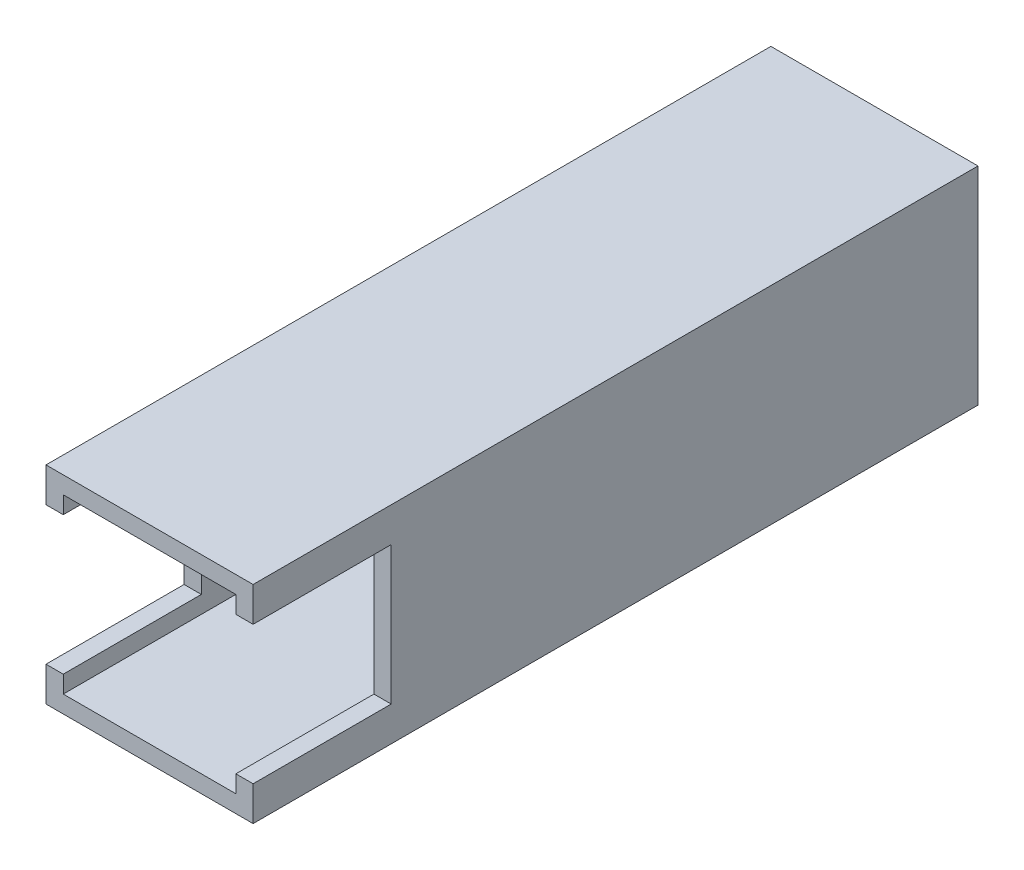
ISO-10303-21;
HEADER;
FILE_DESCRIPTION(('STEP AP214'),'2;1');
FILE_NAME('part.step','',(''),(''),'','','');
FILE_SCHEMA(('AUTOMOTIVE_DESIGN { 1 0 10303 214 1 1 1 1 }'));
ENDSEC;
DATA;
#1=APPLICATION_CONTEXT('core data for automotive mechanical design processes');
#2=APPLICATION_PROTOCOL_DEFINITION('international standard','automotive_design',2000,#1);
#3=PRODUCT_CONTEXT('',#1,'mechanical');
#4=PRODUCT('Part','Part','',(#3));
#5=PRODUCT_RELATED_PRODUCT_CATEGORY('part','',(#4));
#6=PRODUCT_DEFINITION_FORMATION('','',#4);
#7=PRODUCT_DEFINITION_CONTEXT('part definition',#1,'design');
#8=PRODUCT_DEFINITION('design','',#6,#7);
#9=PRODUCT_DEFINITION_SHAPE('','',#8);
#10=(LENGTH_UNIT() NAMED_UNIT(*) SI_UNIT(.MILLI.,.METRE.));
#11=(NAMED_UNIT(*) PLANE_ANGLE_UNIT() SI_UNIT($,.RADIAN.));
#12=(NAMED_UNIT(*) SI_UNIT($,.STERADIAN.) SOLID_ANGLE_UNIT());
#13=UNCERTAINTY_MEASURE_WITH_UNIT(LENGTH_MEASURE(1.E-05),#10,'distance_accuracy_value','');
#14=(GEOMETRIC_REPRESENTATION_CONTEXT(3) GLOBAL_UNCERTAINTY_ASSIGNED_CONTEXT((#13)) GLOBAL_UNIT_ASSIGNED_CONTEXT((#10,
#11,#12)) REPRESENTATION_CONTEXT('',''));
#15=CARTESIAN_POINT('',(0.,0.,0.));
#16=DIRECTION('',(0.,0.,1.));
#17=DIRECTION('',(1.,0.,0.));
#18=AXIS2_PLACEMENT_3D('',#15,#16,#17);
#19=CARTESIAN_POINT('',(-19.05,19.05,66.675));
#20=DIRECTION('',(0.,0.,-1.));
#21=DIRECTION('',(-1.,0.,0.));
#22=AXIS2_PLACEMENT_3D('',#19,#20,#21);
#23=PLANE('',#22);
#24=DIRECTION('',(0.,-1.,0.));
#25=VECTOR('',#24,1.);
#26=CARTESIAN_POINT('',(-19.05,19.05,66.675));
#27=LINE('',#26,#25);
#28=CARTESIAN_POINT('',(-19.05,19.05,66.675));
#29=VERTEX_POINT('',#28);
#30=CARTESIAN_POINT('',(-19.05,12.7,66.675));
#31=VERTEX_POINT('',#30);
#32=EDGE_CURVE('E170',#29,#31,#27,.T.);
#33=ORIENTED_EDGE('',*,*,#32,.T.);
#34=DIRECTION('',(1.,0.,0.));
#35=VECTOR('',#34,1.);
#36=CARTESIAN_POINT('',(-19.05,12.7,66.675));
#37=LINE('',#36,#35);
#38=CARTESIAN_POINT('',(-15.875,12.7,66.675));
#39=VERTEX_POINT('',#38);
#40=EDGE_CURVE('E201',#31,#39,#37,.T.);
#41=ORIENTED_EDGE('',*,*,#40,.T.);
#42=DIRECTION('',(0.,-1.,0.));
#43=VECTOR('',#42,1.);
#44=CARTESIAN_POINT('',(-15.875,15.875,66.675));
#45=LINE('',#44,#43);
#46=CARTESIAN_POINT('',(-15.875,15.875,66.675));
#47=VERTEX_POINT('',#46);
#48=EDGE_CURVE('E226',#47,#39,#45,.T.);
#49=ORIENTED_EDGE('',*,*,#48,.F.);
#50=DIRECTION('',(-1.,0.,0.));
#51=VECTOR('',#50,1.);
#52=CARTESIAN_POINT('',(-15.875,15.875,66.675));
#53=LINE('',#52,#51);
#54=CARTESIAN_POINT('',(15.875,15.875,66.675));
#55=VERTEX_POINT('',#54);
#56=EDGE_CURVE('E216',#55,#47,#53,.T.);
#57=ORIENTED_EDGE('',*,*,#56,.F.);
#58=DIRECTION('',(0.,1.,0.));
#59=VECTOR('',#58,1.);
#60=CARTESIAN_POINT('',(15.875,15.875,66.675));
#61=LINE('',#60,#59);
#62=CARTESIAN_POINT('',(15.875,12.7,66.675));
#63=VERTEX_POINT('',#62);
#64=EDGE_CURVE('E232',#63,#55,#61,.T.);
#65=ORIENTED_EDGE('',*,*,#64,.F.);
#66=CARTESIAN_POINT('',(19.05,12.7,66.675));
#67=VERTEX_POINT('',#66);
#68=EDGE_CURVE('E198',#63,#67,#37,.T.);
#69=ORIENTED_EDGE('',*,*,#68,.T.);
#70=DIRECTION('',(0.,-1.,0.));
#71=VECTOR('',#70,1.);
#72=CARTESIAN_POINT('',(19.05,19.05,66.675));
#73=LINE('',#72,#71);
#74=CARTESIAN_POINT('',(19.05,19.05,66.675));
#75=VERTEX_POINT('',#74);
#76=EDGE_CURVE('E171',#75,#67,#73,.T.);
#77=ORIENTED_EDGE('',*,*,#76,.F.);
#78=DIRECTION('',(1.,0.,0.));
#79=VECTOR('',#78,1.);
#80=CARTESIAN_POINT('',(-19.05,19.05,66.675));
#81=LINE('',#80,#79);
#82=EDGE_CURVE('E249',#29,#75,#81,.T.);
#83=ORIENTED_EDGE('',*,*,#82,.F.);
#84=EDGE_LOOP('',(#33,#41,#49,#57,#65,#69,#77,#83));
#85=FACE_BOUND('',#84,.T.);
#86=ADVANCED_FACE('F33',(#85),#23,.F.);
#87=CARTESIAN_POINT('',(-19.05,19.05,-66.675));
#88=DIRECTION('',(1.,0.,0.));
#89=DIRECTION('',(0.,0.,-1.));
#90=AXIS2_PLACEMENT_3D('',#87,#88,#89);
#91=PLANE('',#90);
#92=DIRECTION('',(0.,1.,0.));
#93=VECTOR('',#92,1.);
#94=CARTESIAN_POINT('',(-19.05,12.7,41.275));
#95=LINE('',#94,#93);
#96=CARTESIAN_POINT('',(-19.05,-12.7,41.275));
#97=VERTEX_POINT('',#96);
#98=CARTESIAN_POINT('',(-19.05,12.7,41.275));
#99=VERTEX_POINT('',#98);
#100=EDGE_CURVE('E152',#97,#99,#95,.T.);
#101=ORIENTED_EDGE('',*,*,#100,.T.);
#102=DIRECTION('',(0.,0.,1.));
#103=VECTOR('',#102,1.);
#104=CARTESIAN_POINT('',(-19.05,12.7,66.675));
#105=LINE('',#104,#103);
#106=EDGE_CURVE('E440',#99,#31,#105,.T.);
#107=ORIENTED_EDGE('',*,*,#106,.T.);
#108=ORIENTED_EDGE('',*,*,#32,.F.);
#109=DIRECTION('',(0.,0.,1.));
#110=VECTOR('',#109,1.);
#111=CARTESIAN_POINT('',(-19.05,19.05,-66.675));
#112=LINE('',#111,#110);
#113=CARTESIAN_POINT('',(-19.05,19.05,-66.675));
#114=VERTEX_POINT('',#113);
#115=EDGE_CURVE('E246',#114,#29,#112,.T.);
#116=ORIENTED_EDGE('',*,*,#115,.F.);
#117=DIRECTION('',(0.,-1.,0.));
#118=VECTOR('',#117,1.);
#119=CARTESIAN_POINT('',(-19.05,19.05,-66.675));
#120=LINE('',#119,#118);
#121=CARTESIAN_POINT('',(-19.05,-19.05,-66.675));
#122=VERTEX_POINT('',#121);
#123=EDGE_CURVE('E256',#114,#122,#120,.T.);
#124=ORIENTED_EDGE('',*,*,#123,.T.);
#125=DIRECTION('',(0.,0.,1.));
#126=VECTOR('',#125,1.);
#127=CARTESIAN_POINT('',(-19.05,-19.05,-66.675));
#128=LINE('',#127,#126);
#129=CARTESIAN_POINT('',(-19.05,-19.05,66.675));
#130=VERTEX_POINT('',#129);
#131=EDGE_CURVE('E169',#122,#130,#128,.T.);
#132=ORIENTED_EDGE('',*,*,#131,.T.);
#133=CARTESIAN_POINT('',(-19.05,-12.7,66.675));
#134=VERTEX_POINT('',#133);
#135=EDGE_CURVE('E160',#134,#130,#27,.T.);
#136=ORIENTED_EDGE('',*,*,#135,.F.);
#137=DIRECTION('',(0.,0.,-1.));
#138=VECTOR('',#137,1.);
#139=CARTESIAN_POINT('',(-19.05,-12.7,66.675));
#140=LINE('',#139,#138);
#141=EDGE_CURVE('E144',#134,#97,#140,.T.);
#142=ORIENTED_EDGE('',*,*,#141,.T.);
#143=EDGE_LOOP('',(#101,#107,#108,#116,#124,#132,#136,#142));
#144=FACE_BOUND('',#143,.T.);
#145=ADVANCED_FACE('F35',(#144),#91,.F.);
#146=CARTESIAN_POINT('',(19.05,-12.7,66.675));
#147=VERTEX_POINT('',#146);
#148=CARTESIAN_POINT('',(19.05,-19.05,66.675));
#149=VERTEX_POINT('',#148);
#150=EDGE_CURVE('E176',#147,#149,#73,.T.);
#151=ORIENTED_EDGE('',*,*,#150,.F.);
#152=DIRECTION('',(1.,0.,0.));
#153=VECTOR('',#152,1.);
#154=CARTESIAN_POINT('',(-19.05,-12.7,66.675));
#155=LINE('',#154,#153);
#156=CARTESIAN_POINT('',(15.875,-12.7,66.675));
#157=VERTEX_POINT('',#156);
#158=EDGE_CURVE('E164',#157,#147,#155,.T.);
#159=ORIENTED_EDGE('',*,*,#158,.F.);
#160=CARTESIAN_POINT('',(15.875,-15.875,66.675));
#161=VERTEX_POINT('',#160);
#162=EDGE_CURVE('E233',#161,#157,#61,.T.);
#163=ORIENTED_EDGE('',*,*,#162,.F.);
#164=DIRECTION('',(1.,0.,0.));
#165=VECTOR('',#164,1.);
#166=CARTESIAN_POINT('',(-15.875,-15.875,66.675));
#167=LINE('',#166,#165);
#168=CARTESIAN_POINT('',(-15.875,-15.875,66.675));
#169=VERTEX_POINT('',#168);
#170=EDGE_CURVE('E229',#169,#161,#167,.T.);
#171=ORIENTED_EDGE('',*,*,#170,.F.);
#172=CARTESIAN_POINT('',(-15.875,-12.7,66.675));
#173=VERTEX_POINT('',#172);
#174=EDGE_CURVE('E163',#173,#169,#45,.T.);
#175=ORIENTED_EDGE('',*,*,#174,.F.);
#176=EDGE_CURVE('E48',#134,#173,#155,.T.);
#177=ORIENTED_EDGE('',*,*,#176,.F.);
#178=ORIENTED_EDGE('',*,*,#135,.T.);
#179=DIRECTION('',(1.,0.,0.));
#180=VECTOR('',#179,1.);
#181=CARTESIAN_POINT('',(-19.05,-19.05,66.675));
#182=LINE('',#181,#180);
#183=EDGE_CURVE('E258',#130,#149,#182,.T.);
#184=ORIENTED_EDGE('',*,*,#183,.T.);
#185=EDGE_LOOP('',(#151,#159,#163,#171,#175,#177,#178,#184));
#186=FACE_BOUND('',#185,.T.);
#187=ADVANCED_FACE('F158',(#186),#23,.F.);
#188=CARTESIAN_POINT('',(19.05,19.05,-66.675));
#189=DIRECTION('',(-1.,0.,0.));
#190=DIRECTION('',(0.,0.,1.));
#191=AXIS2_PLACEMENT_3D('',#188,#189,#190);
#192=PLANE('',#191);
#193=ORIENTED_EDGE('',*,*,#76,.T.);
#194=DIRECTION('',(0.,0.,1.));
#195=VECTOR('',#194,1.);
#196=CARTESIAN_POINT('',(19.05,12.7,66.675));
#197=LINE('',#196,#195);
#198=CARTESIAN_POINT('',(19.05,12.7,41.275));
#199=VERTEX_POINT('',#198);
#200=EDGE_CURVE('E153',#199,#67,#197,.T.);
#201=ORIENTED_EDGE('',*,*,#200,.F.);
#202=DIRECTION('',(0.,1.,0.));
#203=VECTOR('',#202,1.);
#204=CARTESIAN_POINT('',(19.05,12.7,41.275));
#205=LINE('',#204,#203);
#206=CARTESIAN_POINT('',(19.05,-12.7,41.275));
#207=VERTEX_POINT('',#206);
#208=EDGE_CURVE('E192',#207,#199,#205,.T.);
#209=ORIENTED_EDGE('',*,*,#208,.F.);
#210=DIRECTION('',(0.,0.,-1.));
#211=VECTOR('',#210,1.);
#212=CARTESIAN_POINT('',(19.05,-12.7,66.675));
#213=LINE('',#212,#211);
#214=EDGE_CURVE('E273',#147,#207,#213,.T.);
#215=ORIENTED_EDGE('',*,*,#214,.F.);
#216=ORIENTED_EDGE('',*,*,#150,.T.);
#217=DIRECTION('',(0.,0.,-1.));
#218=VECTOR('',#217,1.);
#219=CARTESIAN_POINT('',(19.05,-19.05,-66.675));
#220=LINE('',#219,#218);
#221=CARTESIAN_POINT('',(19.05,-19.05,-66.675));
#222=VERTEX_POINT('',#221);
#223=EDGE_CURVE('E260',#149,#222,#220,.T.);
#224=ORIENTED_EDGE('',*,*,#223,.T.);
#225=DIRECTION('',(0.,-1.,0.));
#226=VECTOR('',#225,1.);
#227=CARTESIAN_POINT('',(19.05,19.05,-66.675));
#228=LINE('',#227,#226);
#229=CARTESIAN_POINT('',(19.05,19.05,-66.675));
#230=VERTEX_POINT('',#229);
#231=EDGE_CURVE('E263',#230,#222,#228,.T.);
#232=ORIENTED_EDGE('',*,*,#231,.F.);
#233=DIRECTION('',(0.,0.,-1.));
#234=VECTOR('',#233,1.);
#235=CARTESIAN_POINT('',(19.05,19.05,-66.675));
#236=LINE('',#235,#234);
#237=EDGE_CURVE('E252',#75,#230,#236,.T.);
#238=ORIENTED_EDGE('',*,*,#237,.F.);
#239=EDGE_LOOP('',(#193,#201,#209,#215,#216,#224,#232,#238));
#240=FACE_BOUND('',#239,.T.);
#241=ADVANCED_FACE('F271',(#240),#192,.F.);
#242=CARTESIAN_POINT('',(-19.05,19.05,-66.675));
#243=DIRECTION('',(0.,0.,1.));
#244=DIRECTION('',(1.,0.,0.));
#245=AXIS2_PLACEMENT_3D('',#242,#243,#244);
#246=PLANE('',#245);
#247=DIRECTION('',(-1.,0.,0.));
#248=VECTOR('',#247,1.);
#249=CARTESIAN_POINT('',(-15.875,15.875,-66.675));
#250=LINE('',#249,#248);
#251=CARTESIAN_POINT('',(15.875,15.875,-66.675));
#252=VERTEX_POINT('',#251);
#253=CARTESIAN_POINT('',(-15.875,15.875,-66.675));
#254=VERTEX_POINT('',#253);
#255=EDGE_CURVE('E222',#252,#254,#250,.T.);
#256=ORIENTED_EDGE('',*,*,#255,.T.);
#257=DIRECTION('',(0.,-1.,0.));
#258=VECTOR('',#257,1.);
#259=CARTESIAN_POINT('',(-15.875,15.875,-66.675));
#260=LINE('',#259,#258);
#261=CARTESIAN_POINT('',(-15.875,-15.875,-66.675));
#262=VERTEX_POINT('',#261);
#263=EDGE_CURVE('E212',#254,#262,#260,.T.);
#264=ORIENTED_EDGE('',*,*,#263,.T.);
#265=DIRECTION('',(1.,0.,0.));
#266=VECTOR('',#265,1.);
#267=CARTESIAN_POINT('',(-15.875,-15.875,-66.675));
#268=LINE('',#267,#266);
#269=CARTESIAN_POINT('',(15.875,-15.875,-66.675));
#270=VERTEX_POINT('',#269);
#271=EDGE_CURVE('E215',#262,#270,#268,.T.);
#272=ORIENTED_EDGE('',*,*,#271,.T.);
#273=DIRECTION('',(0.,1.,0.));
#274=VECTOR('',#273,1.);
#275=CARTESIAN_POINT('',(15.875,15.875,-66.675));
#276=LINE('',#275,#274);
#277=EDGE_CURVE('E219',#270,#252,#276,.T.);
#278=ORIENTED_EDGE('',*,*,#277,.T.);
#279=EDGE_LOOP('',(#256,#264,#272,#278));
#280=FACE_BOUND('',#279,.T.);
#281=DIRECTION('',(-1.,0.,0.));
#282=VECTOR('',#281,1.);
#283=CARTESIAN_POINT('',(-19.05,-19.05,-66.675));
#284=LINE('',#283,#282);
#285=EDGE_CURVE('E250',#222,#122,#284,.T.);
#286=ORIENTED_EDGE('',*,*,#285,.T.);
#287=ORIENTED_EDGE('',*,*,#123,.F.);
#288=DIRECTION('',(-1.,0.,0.));
#289=VECTOR('',#288,1.);
#290=CARTESIAN_POINT('',(-19.05,19.05,-66.675));
#291=LINE('',#290,#289);
#292=EDGE_CURVE('E254',#230,#114,#291,.T.);
#293=ORIENTED_EDGE('',*,*,#292,.F.);
#294=ORIENTED_EDGE('',*,*,#231,.T.);
#295=EDGE_LOOP('',(#286,#287,#293,#294));
#296=FACE_BOUND('',#295,.T.);
#297=ADVANCED_FACE('F278',(#280,#296),#246,.F.);
#298=CARTESIAN_POINT('',(0.,19.05,0.));
#299=DIRECTION('',(0.,1.,0.));
#300=DIRECTION('',(0.,0.,1.));
#301=AXIS2_PLACEMENT_3D('',#298,#299,#300);
#302=PLANE('',#301);
#303=ORIENTED_EDGE('',*,*,#115,.T.);
#304=ORIENTED_EDGE('',*,*,#82,.T.);
#305=ORIENTED_EDGE('',*,*,#237,.T.);
#306=ORIENTED_EDGE('',*,*,#292,.T.);
#307=EDGE_LOOP('',(#303,#304,#305,#306));
#308=FACE_BOUND('',#307,.T.);
#309=ADVANCED_FACE('F283',(#308),#302,.T.);
#310=CARTESIAN_POINT('',(0.,-19.05,0.));
#311=DIRECTION('',(0.,1.,0.));
#312=DIRECTION('',(0.,0.,1.));
#313=AXIS2_PLACEMENT_3D('',#310,#311,#312);
#314=PLANE('',#313);
#315=ORIENTED_EDGE('',*,*,#131,.F.);
#316=ORIENTED_EDGE('',*,*,#285,.F.);
#317=ORIENTED_EDGE('',*,*,#223,.F.);
#318=ORIENTED_EDGE('',*,*,#183,.F.);
#319=EDGE_LOOP('',(#315,#316,#317,#318));
#320=FACE_BOUND('',#319,.T.);
#321=ADVANCED_FACE('F276',(#320),#314,.F.);
#322=CARTESIAN_POINT('',(-15.875,15.875,-66.675));
#323=DIRECTION('',(-1.,0.,0.));
#324=DIRECTION('',(0.,-1.,0.));
#325=AXIS2_PLACEMENT_3D('',#322,#323,#324);
#326=PLANE('',#325);
#327=ORIENTED_EDGE('',*,*,#48,.T.);
#328=DIRECTION('',(0.,0.,-1.));
#329=VECTOR('',#328,1.);
#330=CARTESIAN_POINT('',(-15.875,12.7,-66.675));
#331=LINE('',#330,#329);
#332=CARTESIAN_POINT('',(-15.875,12.7,41.275));
#333=VERTEX_POINT('',#332);
#334=EDGE_CURVE('E209',#39,#333,#331,.T.);
#335=ORIENTED_EDGE('',*,*,#334,.T.);
#336=DIRECTION('',(0.,-1.,0.));
#337=VECTOR('',#336,1.);
#338=CARTESIAN_POINT('',(-15.875,15.875,41.275));
#339=LINE('',#338,#337);
#340=CARTESIAN_POINT('',(-15.875,-12.7,41.275));
#341=VERTEX_POINT('',#340);
#342=EDGE_CURVE('E206',#333,#341,#339,.T.);
#343=ORIENTED_EDGE('',*,*,#342,.T.);
#344=DIRECTION('',(0.,0.,1.));
#345=VECTOR('',#344,1.);
#346=CARTESIAN_POINT('',(-15.875,-12.7,-66.675));
#347=LINE('',#346,#345);
#348=EDGE_CURVE('E204',#341,#173,#347,.T.);
#349=ORIENTED_EDGE('',*,*,#348,.T.);
#350=ORIENTED_EDGE('',*,*,#174,.T.);
#351=DIRECTION('',(0.,0.,1.));
#352=VECTOR('',#351,1.);
#353=CARTESIAN_POINT('',(-15.875,-15.875,-66.675));
#354=LINE('',#353,#352);
#355=EDGE_CURVE('E225',#262,#169,#354,.T.);
#356=ORIENTED_EDGE('',*,*,#355,.F.);
#357=ORIENTED_EDGE('',*,*,#263,.F.);
#358=DIRECTION('',(0.,0.,1.));
#359=VECTOR('',#358,1.);
#360=CARTESIAN_POINT('',(-15.875,15.875,-66.675));
#361=LINE('',#360,#359);
#362=EDGE_CURVE('E237',#254,#47,#361,.T.);
#363=ORIENTED_EDGE('',*,*,#362,.T.);
#364=EDGE_LOOP('',(#327,#335,#343,#349,#350,#356,#357,#363));
#365=FACE_BOUND('',#364,.T.);
#366=ADVANCED_FACE('F294',(#365),#326,.F.);
#367=CARTESIAN_POINT('',(-15.875,15.875,-66.675));
#368=DIRECTION('',(0.,1.,0.));
#369=DIRECTION('',(0.,0.,1.));
#370=AXIS2_PLACEMENT_3D('',#367,#368,#369);
#371=PLANE('',#370);
#372=ORIENTED_EDGE('',*,*,#56,.T.);
#373=ORIENTED_EDGE('',*,*,#362,.F.);
#374=ORIENTED_EDGE('',*,*,#255,.F.);
#375=DIRECTION('',(0.,0.,1.));
#376=VECTOR('',#375,1.);
#377=CARTESIAN_POINT('',(15.875,15.875,-66.675));
#378=LINE('',#377,#376);
#379=EDGE_CURVE('E239',#252,#55,#378,.T.);
#380=ORIENTED_EDGE('',*,*,#379,.T.);
#381=EDGE_LOOP('',(#372,#373,#374,#380));
#382=FACE_BOUND('',#381,.T.);
#383=ADVANCED_FACE('F298',(#382),#371,.F.);
#384=CARTESIAN_POINT('',(15.875,15.875,-66.675));
#385=DIRECTION('',(1.,0.,0.));
#386=DIRECTION('',(0.,1.,0.));
#387=AXIS2_PLACEMENT_3D('',#384,#385,#386);
#388=PLANE('',#387);
#389=DIRECTION('',(0.,1.,0.));
#390=VECTOR('',#389,1.);
#391=CARTESIAN_POINT('',(15.875,15.875,41.275));
#392=LINE('',#391,#390);
#393=CARTESIAN_POINT('',(15.875,-12.7,41.275));
#394=VERTEX_POINT('',#393);
#395=CARTESIAN_POINT('',(15.875,12.7,41.275));
#396=VERTEX_POINT('',#395);
#397=EDGE_CURVE('E41',#394,#396,#392,.T.);
#398=ORIENTED_EDGE('',*,*,#397,.T.);
#399=DIRECTION('',(0.,0.,1.));
#400=VECTOR('',#399,1.);
#401=CARTESIAN_POINT('',(15.875,12.7,-66.675));
#402=LINE('',#401,#400);
#403=EDGE_CURVE('E11',#396,#63,#402,.T.);
#404=ORIENTED_EDGE('',*,*,#403,.T.);
#405=ORIENTED_EDGE('',*,*,#64,.T.);
#406=ORIENTED_EDGE('',*,*,#379,.F.);
#407=ORIENTED_EDGE('',*,*,#277,.F.);
#408=DIRECTION('',(0.,0.,1.));
#409=VECTOR('',#408,1.);
#410=CARTESIAN_POINT('',(15.875,-15.875,-66.675));
#411=LINE('',#410,#409);
#412=EDGE_CURVE('E242',#270,#161,#411,.T.);
#413=ORIENTED_EDGE('',*,*,#412,.T.);
#414=ORIENTED_EDGE('',*,*,#162,.T.);
#415=DIRECTION('',(0.,0.,-1.));
#416=VECTOR('',#415,1.);
#417=CARTESIAN_POINT('',(15.875,-12.7,-66.675));
#418=LINE('',#417,#416);
#419=EDGE_CURVE('E174',#157,#394,#418,.T.);
#420=ORIENTED_EDGE('',*,*,#419,.T.);
#421=EDGE_LOOP('',(#398,#404,#405,#406,#407,#413,#414,#420));
#422=FACE_BOUND('',#421,.T.);
#423=ADVANCED_FACE('F183',(#422),#388,.F.);
#424=CARTESIAN_POINT('',(-15.875,-15.875,-66.675));
#425=DIRECTION('',(0.,-1.,0.));
#426=DIRECTION('',(0.,0.,-1.));
#427=AXIS2_PLACEMENT_3D('',#424,#425,#426);
#428=PLANE('',#427);
#429=ORIENTED_EDGE('',*,*,#170,.T.);
#430=ORIENTED_EDGE('',*,*,#412,.F.);
#431=ORIENTED_EDGE('',*,*,#271,.F.);
#432=ORIENTED_EDGE('',*,*,#355,.T.);
#433=EDGE_LOOP('',(#429,#430,#431,#432));
#434=FACE_BOUND('',#433,.T.);
#435=ADVANCED_FACE('F303',(#434),#428,.F.);
#436=CARTESIAN_POINT('',(-19.05,-12.7,66.675));
#437=DIRECTION('',(0.,-1.,0.));
#438=DIRECTION('',(0.,0.,-1.));
#439=AXIS2_PLACEMENT_3D('',#436,#437,#438);
#440=PLANE('',#439);
#441=ORIENTED_EDGE('',*,*,#158,.T.);
#442=ORIENTED_EDGE('',*,*,#214,.T.);
#443=DIRECTION('',(1.,0.,0.));
#444=VECTOR('',#443,1.);
#445=CARTESIAN_POINT('',(-19.05,-12.7,41.275));
#446=LINE('',#445,#444);
#447=EDGE_CURVE('E56',#394,#207,#446,.T.);
#448=ORIENTED_EDGE('',*,*,#447,.F.);
#449=ORIENTED_EDGE('',*,*,#419,.F.);
#450=EDGE_LOOP('',(#441,#442,#448,#449));
#451=FACE_BOUND('',#450,.T.);
#452=ADVANCED_FACE('F355',(#451),#440,.F.);
#453=CARTESIAN_POINT('',(-19.05,12.7,41.275));
#454=DIRECTION('',(0.,0.,-1.));
#455=DIRECTION('',(-1.,0.,0.));
#456=AXIS2_PLACEMENT_3D('',#453,#454,#455);
#457=PLANE('',#456);
#458=ORIENTED_EDGE('',*,*,#447,.T.);
#459=ORIENTED_EDGE('',*,*,#208,.T.);
#460=DIRECTION('',(1.,0.,0.));
#461=VECTOR('',#460,1.);
#462=CARTESIAN_POINT('',(-19.05,12.7,41.275));
#463=LINE('',#462,#461);
#464=EDGE_CURVE('E190',#396,#199,#463,.T.);
#465=ORIENTED_EDGE('',*,*,#464,.F.);
#466=ORIENTED_EDGE('',*,*,#397,.F.);
#467=EDGE_LOOP('',(#458,#459,#465,#466));
#468=FACE_BOUND('',#467,.T.);
#469=ADVANCED_FACE('F188',(#468),#457,.F.);
#470=CARTESIAN_POINT('',(-19.05,12.7,66.675));
#471=DIRECTION('',(0.,1.,0.));
#472=DIRECTION('',(0.,0.,1.));
#473=AXIS2_PLACEMENT_3D('',#470,#471,#472);
#474=PLANE('',#473);
#475=ORIENTED_EDGE('',*,*,#464,.T.);
#476=ORIENTED_EDGE('',*,*,#200,.T.);
#477=ORIENTED_EDGE('',*,*,#68,.F.);
#478=ORIENTED_EDGE('',*,*,#403,.F.);
#479=EDGE_LOOP('',(#475,#476,#477,#478));
#480=FACE_BOUND('',#479,.T.);
#481=ADVANCED_FACE('F369',(#480),#474,.F.);
#482=ORIENTED_EDGE('',*,*,#40,.F.);
#483=ORIENTED_EDGE('',*,*,#106,.F.);
#484=EDGE_CURVE('E195',#99,#333,#463,.T.);
#485=ORIENTED_EDGE('',*,*,#484,.T.);
#486=ORIENTED_EDGE('',*,*,#334,.F.);
#487=EDGE_LOOP('',(#482,#483,#485,#486));
#488=FACE_BOUND('',#487,.T.);
#489=ADVANCED_FACE('F379',(#488),#474,.F.);
#490=ORIENTED_EDGE('',*,*,#484,.F.);
#491=ORIENTED_EDGE('',*,*,#100,.F.);
#492=EDGE_CURVE('E147',#97,#341,#446,.T.);
#493=ORIENTED_EDGE('',*,*,#492,.T.);
#494=ORIENTED_EDGE('',*,*,#342,.F.);
#495=EDGE_LOOP('',(#490,#491,#493,#494));
#496=FACE_BOUND('',#495,.T.);
#497=ADVANCED_FACE('F371',(#496),#457,.F.);
#498=ORIENTED_EDGE('',*,*,#492,.F.);
#499=ORIENTED_EDGE('',*,*,#141,.F.);
#500=ORIENTED_EDGE('',*,*,#176,.T.);
#501=ORIENTED_EDGE('',*,*,#348,.F.);
#502=EDGE_LOOP('',(#498,#499,#500,#501));
#503=FACE_BOUND('',#502,.T.);
#504=ADVANCED_FACE('F145',(#503),#440,.F.);
#505=CLOSED_SHELL('',(#86,#145,#187,#241,#297,#309,#321,#366,#383,#423,#435,#452,#469,#481,#489,
#497,#504));
#506=MANIFOLD_SOLID_BREP('B2',#505);
#507=ADVANCED_BREP_SHAPE_REPRESENTATION('',(#18,#506),#14);
#508=SHAPE_DEFINITION_REPRESENTATION(#9,#507);
ENDSEC;
END-ISO-10303-21;
